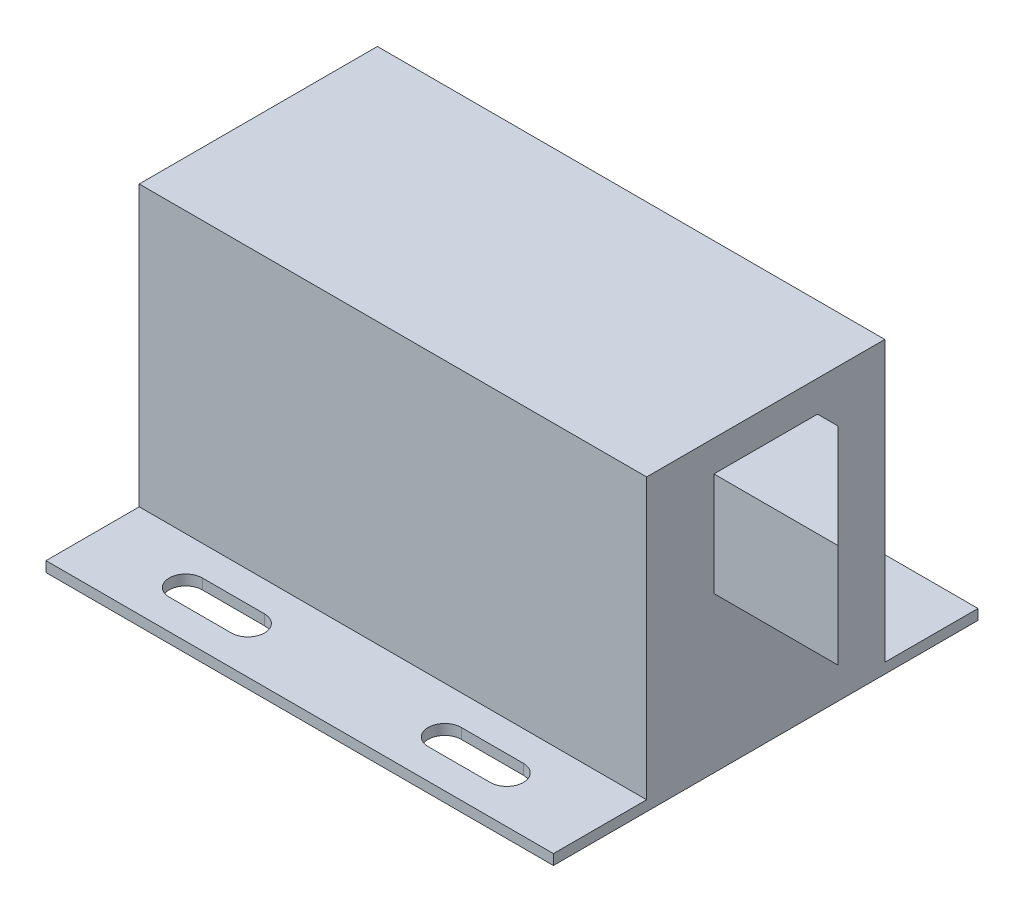
ISO-10303-21;
HEADER;
FILE_DESCRIPTION(('STEP AP214'),'2;1');
FILE_NAME('part.step','',(''),(''),'','','');
FILE_SCHEMA(('AUTOMOTIVE_DESIGN { 1 0 10303 214 1 1 1 1 }'));
ENDSEC;
DATA;
#1=APPLICATION_CONTEXT('core data for automotive mechanical design processes');
#2=APPLICATION_PROTOCOL_DEFINITION('international standard','automotive_design',2000,#1);
#3=PRODUCT_CONTEXT('',#1,'mechanical');
#4=PRODUCT('Part','Part','',(#3));
#5=PRODUCT_RELATED_PRODUCT_CATEGORY('part','',(#4));
#6=PRODUCT_DEFINITION_FORMATION('','',#4);
#7=PRODUCT_DEFINITION_CONTEXT('part definition',#1,'design');
#8=PRODUCT_DEFINITION('design','',#6,#7);
#9=PRODUCT_DEFINITION_SHAPE('','',#8);
#10=(LENGTH_UNIT() NAMED_UNIT(*) SI_UNIT(.MILLI.,.METRE.));
#11=(NAMED_UNIT(*) PLANE_ANGLE_UNIT() SI_UNIT($,.RADIAN.));
#12=(NAMED_UNIT(*) SI_UNIT($,.STERADIAN.) SOLID_ANGLE_UNIT());
#13=UNCERTAINTY_MEASURE_WITH_UNIT(LENGTH_MEASURE(1.E-05),#10,'distance_accuracy_value','');
#14=(GEOMETRIC_REPRESENTATION_CONTEXT(3) GLOBAL_UNCERTAINTY_ASSIGNED_CONTEXT((#13)) GLOBAL_UNIT_ASSIGNED_CONTEXT((#10,
#11,#12)) REPRESENTATION_CONTEXT('',''));
#15=CARTESIAN_POINT('',(0.,0.,0.));
#16=DIRECTION('',(0.,0.,1.));
#17=DIRECTION('',(1.,0.,0.));
#18=AXIS2_PLACEMENT_3D('',#15,#16,#17);
#19=CARTESIAN_POINT('',(49.,1.,0.));
#20=DIRECTION('',(-1.,0.,0.));
#21=DIRECTION('',(0.,0.,1.));
#22=AXIS2_PLACEMENT_3D('',#19,#20,#21);
#23=PLANE('',#22);
#24=DIRECTION('',(0.,0.,-1.));
#25=VECTOR('',#24,1.);
#26=CARTESIAN_POINT('',(49.,0.,0.));
#27=LINE('',#26,#25);
#28=CARTESIAN_POINT('',(49.,0.,0.));
#29=VERTEX_POINT('',#28);
#30=CARTESIAN_POINT('',(49.,0.,-41.));
#31=VERTEX_POINT('',#30);
#32=EDGE_CURVE('E336',#29,#31,#27,.T.);
#33=ORIENTED_EDGE('',*,*,#32,.T.);
#34=DIRECTION('',(0.,-1.,0.));
#35=VECTOR('',#34,1.);
#36=CARTESIAN_POINT('',(49.,1.,-41.));
#37=LINE('',#36,#35);
#38=CARTESIAN_POINT('',(49.,1.,-41.));
#39=VERTEX_POINT('',#38);
#40=EDGE_CURVE('E301',#39,#31,#37,.T.);
#41=ORIENTED_EDGE('',*,*,#40,.F.);
#42=DIRECTION('',(0.,0.,-1.));
#43=VECTOR('',#42,1.);
#44=CARTESIAN_POINT('',(49.,1.,0.));
#45=LINE('',#44,#43);
#46=CARTESIAN_POINT('',(49.,1.,-32.));
#47=VERTEX_POINT('',#46);
#48=EDGE_CURVE('E267',#47,#39,#45,.T.);
#49=ORIENTED_EDGE('',*,*,#48,.F.);
#50=DIRECTION('',(0.,-1.,0.));
#51=VECTOR('',#50,1.);
#52=CARTESIAN_POINT('',(49.,28.,-32.));
#53=LINE('',#52,#51);
#54=CARTESIAN_POINT('',(49.,28.,-32.));
#55=VERTEX_POINT('',#54);
#56=EDGE_CURVE('E274',#55,#47,#53,.T.);
#57=ORIENTED_EDGE('',*,*,#56,.F.);
#58=DIRECTION('',(0.,0.,-1.));
#59=VECTOR('',#58,1.);
#60=CARTESIAN_POINT('',(49.,28.,-32.));
#61=LINE('',#60,#59);
#62=CARTESIAN_POINT('',(49.,28.,-9.));
#63=VERTEX_POINT('',#62);
#64=EDGE_CURVE('E254',#63,#55,#61,.T.);
#65=ORIENTED_EDGE('',*,*,#64,.F.);
#66=DIRECTION('',(0.,-1.,0.));
#67=VECTOR('',#66,1.);
#68=CARTESIAN_POINT('',(49.,28.,-9.));
#69=LINE('',#68,#67);
#70=CARTESIAN_POINT('',(49.,1.,-9.));
#71=VERTEX_POINT('',#70);
#72=EDGE_CURVE('E270',#63,#71,#69,.T.);
#73=ORIENTED_EDGE('',*,*,#72,.T.);
#74=CARTESIAN_POINT('',(49.,1.,0.));
#75=VERTEX_POINT('',#74);
#76=EDGE_CURVE('E321',#75,#71,#45,.T.);
#77=ORIENTED_EDGE('',*,*,#76,.F.);
#78=DIRECTION('',(0.,-1.,0.));
#79=VECTOR('',#78,1.);
#80=CARTESIAN_POINT('',(49.,1.,0.));
#81=LINE('',#80,#79);
#82=EDGE_CURVE('E294',#75,#29,#81,.T.);
#83=ORIENTED_EDGE('',*,*,#82,.T.);
#84=EDGE_LOOP('',(#33,#41,#49,#57,#65,#73,#77,#83));
#85=FACE_BOUND('',#84,.T.);
#86=DIRECTION('',(0.,-1.,0.));
#87=VECTOR('',#86,1.);
#88=CARTESIAN_POINT('',(49.,15.,-15.5));
#89=LINE('',#88,#87);
#90=CARTESIAN_POINT('',(49.,25.,-15.5));
#91=VERTEX_POINT('',#90);
#92=CARTESIAN_POINT('',(49.,15.,-15.5));
#93=VERTEX_POINT('',#92);
#94=EDGE_CURVE('E229',#91,#93,#89,.T.);
#95=ORIENTED_EDGE('',*,*,#94,.F.);
#96=DIRECTION('',(0.,0.,1.));
#97=VECTOR('',#96,1.);
#98=CARTESIAN_POINT('',(49.,25.,-15.5));
#99=LINE('',#98,#97);
#100=CARTESIAN_POINT('',(49.,25.,-25.5));
#101=VERTEX_POINT('',#100);
#102=EDGE_CURVE('E233',#101,#91,#99,.T.);
#103=ORIENTED_EDGE('',*,*,#102,.F.);
#104=DIRECTION('',(0.,1.,0.));
#105=VECTOR('',#104,1.);
#106=CARTESIAN_POINT('',(49.,15.,-25.5));
#107=LINE('',#106,#105);
#108=CARTESIAN_POINT('',(49.,15.,-25.5));
#109=VERTEX_POINT('',#108);
#110=EDGE_CURVE('E238',#109,#101,#107,.T.);
#111=ORIENTED_EDGE('',*,*,#110,.F.);
#112=DIRECTION('',(0.,0.,-1.));
#113=VECTOR('',#112,1.);
#114=CARTESIAN_POINT('',(49.,15.,-15.5));
#115=LINE('',#114,#113);
#116=EDGE_CURVE('E242',#93,#109,#115,.T.);
#117=ORIENTED_EDGE('',*,*,#116,.F.);
#118=EDGE_LOOP('',(#95,#103,#111,#117));
#119=FACE_BOUND('',#118,.T.);
#120=ADVANCED_FACE('F33',(#85,#119),#23,.F.);
#121=CARTESIAN_POINT('',(0.,1.,0.));
#122=DIRECTION('',(0.,-1.,0.));
#123=DIRECTION('',(0.,0.,-1.));
#124=AXIS2_PLACEMENT_3D('',#121,#122,#123);
#125=PLANE('',#124);
#126=CARTESIAN_POINT('',(34.,1.,-36.5));
#127=DIRECTION('',(0.,1.,0.));
#128=DIRECTION('',(0.,0.,1.));
#129=AXIS2_PLACEMENT_3D('',#126,#127,#128);
#130=CIRCLE('',#129,1.59999999999999);
#131=CARTESIAN_POINT('',(34.,1.,-38.1));
#132=VERTEX_POINT('',#131);
#133=CARTESIAN_POINT('',(34.,1.,-34.9));
#134=VERTEX_POINT('',#133);
#135=EDGE_CURVE('E414',#132,#134,#130,.T.);
#136=ORIENTED_EDGE('',*,*,#135,.F.);
#137=DIRECTION('',(-1.,0.,0.));
#138=VECTOR('',#137,1.);
#139=CARTESIAN_POINT('',(34.,1.,-38.1));
#140=LINE('',#139,#138);
#141=CARTESIAN_POINT('',(40.,1.,-38.1));
#142=VERTEX_POINT('',#141);
#143=EDGE_CURVE('E410',#142,#132,#140,.T.);
#144=ORIENTED_EDGE('',*,*,#143,.F.);
#145=CARTESIAN_POINT('',(40.,1.,-36.5));
#146=DIRECTION('',(0.,1.,0.));
#147=DIRECTION('',(0.,0.,1.));
#148=AXIS2_PLACEMENT_3D('',#145,#146,#147);
#149=CIRCLE('',#148,1.59999999999999);
#150=CARTESIAN_POINT('',(40.,1.,-34.9));
#151=VERTEX_POINT('',#150);
#152=EDGE_CURVE('E426',#151,#142,#149,.T.);
#153=ORIENTED_EDGE('',*,*,#152,.F.);
#154=DIRECTION('',(1.,0.,0.));
#155=VECTOR('',#154,1.);
#156=CARTESIAN_POINT('',(34.,1.,-34.9));
#157=LINE('',#156,#155);
#158=EDGE_CURVE('E429',#134,#151,#157,.T.);
#159=ORIENTED_EDGE('',*,*,#158,.F.);
#160=EDGE_LOOP('',(#136,#144,#153,#159));
#161=FACE_BOUND('',#160,.T.);
#162=CARTESIAN_POINT('',(9.,1.,-36.5));
#163=DIRECTION('',(0.,1.,0.));
#164=DIRECTION('',(0.,0.,1.));
#165=AXIS2_PLACEMENT_3D('',#162,#163,#164);
#166=CIRCLE('',#165,1.59999999999999);
#167=CARTESIAN_POINT('',(9.,1.,-38.1));
#168=VERTEX_POINT('',#167);
#169=CARTESIAN_POINT('',(9.00000000000001,1.,-34.9));
#170=VERTEX_POINT('',#169);
#171=EDGE_CURVE('E384',#168,#170,#166,.T.);
#172=ORIENTED_EDGE('',*,*,#171,.F.);
#173=DIRECTION('',(-1.,0.,0.));
#174=VECTOR('',#173,1.);
#175=CARTESIAN_POINT('',(9.,1.,-38.1));
#176=LINE('',#175,#174);
#177=CARTESIAN_POINT('',(15.,1.,-38.1));
#178=VERTEX_POINT('',#177);
#179=EDGE_CURVE('E380',#178,#168,#176,.T.);
#180=ORIENTED_EDGE('',*,*,#179,.F.);
#181=CARTESIAN_POINT('',(15.,1.,-36.5));
#182=DIRECTION('',(0.,1.,0.));
#183=DIRECTION('',(0.,0.,1.));
#184=AXIS2_PLACEMENT_3D('',#181,#182,#183);
#185=CIRCLE('',#184,1.59999999999999);
#186=CARTESIAN_POINT('',(15.,1.,-34.9));
#187=VERTEX_POINT('',#186);
#188=EDGE_CURVE('E395',#187,#178,#185,.T.);
#189=ORIENTED_EDGE('',*,*,#188,.F.);
#190=DIRECTION('',(1.,0.,0.));
#191=VECTOR('',#190,1.);
#192=CARTESIAN_POINT('',(9.00000000000001,1.,-34.9));
#193=LINE('',#192,#191);
#194=EDGE_CURVE('E398',#170,#187,#193,.T.);
#195=ORIENTED_EDGE('',*,*,#194,.F.);
#196=EDGE_LOOP('',(#172,#180,#189,#195));
#197=FACE_BOUND('',#196,.T.);
#198=DIRECTION('',(-1.,0.,0.));
#199=VECTOR('',#198,1.);
#200=CARTESIAN_POINT('',(0.,1.,-32.));
#201=LINE('',#200,#199);
#202=CARTESIAN_POINT('',(0.,1.,-32.));
#203=VERTEX_POINT('',#202);
#204=EDGE_CURVE('E252',#47,#203,#201,.T.);
#205=ORIENTED_EDGE('',*,*,#204,.F.);
#206=ORIENTED_EDGE('',*,*,#48,.T.);
#207=DIRECTION('',(-1.,0.,0.));
#208=VECTOR('',#207,1.);
#209=CARTESIAN_POINT('',(0.,1.,-41.));
#210=LINE('',#209,#208);
#211=CARTESIAN_POINT('',(0.,1.,-41.));
#212=VERTEX_POINT('',#211);
#213=EDGE_CURVE('E318',#39,#212,#210,.T.);
#214=ORIENTED_EDGE('',*,*,#213,.T.);
#215=DIRECTION('',(0.,0.,1.));
#216=VECTOR('',#215,1.);
#217=CARTESIAN_POINT('',(0.,1.,0.));
#218=LINE('',#217,#216);
#219=EDGE_CURVE('E305',#212,#203,#218,.T.);
#220=ORIENTED_EDGE('',*,*,#219,.T.);
#221=EDGE_LOOP('',(#205,#206,#214,#220));
#222=FACE_BOUND('',#221,.T.);
#223=ADVANCED_FACE('F328',(#161,#197,#222),#125,.F.);
#224=CARTESIAN_POINT('',(15.,1.,-4.5));
#225=DIRECTION('',(0.,1.,0.));
#226=DIRECTION('',(0.,0.,1.));
#227=AXIS2_PLACEMENT_3D('',#224,#225,#226);
#228=CIRCLE('',#227,1.6);
#229=CARTESIAN_POINT('',(15.,1.,-2.9));
#230=VERTEX_POINT('',#229);
#231=CARTESIAN_POINT('',(15.,1.,-6.1));
#232=VERTEX_POINT('',#231);
#233=EDGE_CURVE('E476',#230,#232,#228,.T.);
#234=ORIENTED_EDGE('',*,*,#233,.F.);
#235=DIRECTION('',(1.,0.,0.));
#236=VECTOR('',#235,1.);
#237=CARTESIAN_POINT('',(15.,1.,-2.9));
#238=LINE('',#237,#236);
#239=CARTESIAN_POINT('',(9.,1.,-2.9));
#240=VERTEX_POINT('',#239);
#241=EDGE_CURVE('E472',#240,#230,#238,.T.);
#242=ORIENTED_EDGE('',*,*,#241,.F.);
#243=CARTESIAN_POINT('',(9.,1.,-4.5));
#244=DIRECTION('',(0.,1.,0.));
#245=DIRECTION('',(0.,0.,1.));
#246=AXIS2_PLACEMENT_3D('',#243,#244,#245);
#247=CIRCLE('',#246,1.6);
#248=CARTESIAN_POINT('',(9.,1.,-6.1));
#249=VERTEX_POINT('',#248);
#250=EDGE_CURVE('E486',#249,#240,#247,.T.);
#251=ORIENTED_EDGE('',*,*,#250,.F.);
#252=DIRECTION('',(-1.,0.,0.));
#253=VECTOR('',#252,1.);
#254=CARTESIAN_POINT('',(15.,1.,-6.1));
#255=LINE('',#254,#253);
#256=EDGE_CURVE('E489',#232,#249,#255,.T.);
#257=ORIENTED_EDGE('',*,*,#256,.F.);
#258=EDGE_LOOP('',(#234,#242,#251,#257));
#259=FACE_BOUND('',#258,.T.);
#260=CARTESIAN_POINT('',(34.,1.,-4.5));
#261=DIRECTION('',(0.,1.,0.));
#262=DIRECTION('',(0.,0.,1.));
#263=AXIS2_PLACEMENT_3D('',#260,#261,#262);
#264=CIRCLE('',#263,1.6);
#265=CARTESIAN_POINT('',(34.,1.,-6.1));
#266=VERTEX_POINT('',#265);
#267=CARTESIAN_POINT('',(34.,1.,-2.9));
#268=VERTEX_POINT('',#267);
#269=EDGE_CURVE('E445',#266,#268,#264,.T.);
#270=ORIENTED_EDGE('',*,*,#269,.F.);
#271=DIRECTION('',(-1.,0.,0.));
#272=VECTOR('',#271,1.);
#273=CARTESIAN_POINT('',(34.,1.,-6.1));
#274=LINE('',#273,#272);
#275=CARTESIAN_POINT('',(40.,1.,-6.1));
#276=VERTEX_POINT('',#275);
#277=EDGE_CURVE('E441',#276,#266,#274,.T.);
#278=ORIENTED_EDGE('',*,*,#277,.F.);
#279=CARTESIAN_POINT('',(40.,1.,-4.5));
#280=DIRECTION('',(0.,1.,0.));
#281=DIRECTION('',(0.,0.,1.));
#282=AXIS2_PLACEMENT_3D('',#279,#280,#281);
#283=CIRCLE('',#282,1.6);
#284=CARTESIAN_POINT('',(40.,1.,-2.9));
#285=VERTEX_POINT('',#284);
#286=EDGE_CURVE('E457',#285,#276,#283,.T.);
#287=ORIENTED_EDGE('',*,*,#286,.F.);
#288=DIRECTION('',(1.,0.,0.));
#289=VECTOR('',#288,1.);
#290=CARTESIAN_POINT('',(34.,1.,-2.9));
#291=LINE('',#290,#289);
#292=EDGE_CURVE('E460',#268,#285,#291,.T.);
#293=ORIENTED_EDGE('',*,*,#292,.F.);
#294=EDGE_LOOP('',(#270,#278,#287,#293));
#295=FACE_BOUND('',#294,.T.);
#296=DIRECTION('',(1.,0.,0.));
#297=VECTOR('',#296,1.);
#298=CARTESIAN_POINT('',(0.,1.,-9.));
#299=LINE('',#298,#297);
#300=CARTESIAN_POINT('',(0.,1.,-9.));
#301=VERTEX_POINT('',#300);
#302=EDGE_CURVE('E230',#301,#71,#299,.T.);
#303=ORIENTED_EDGE('',*,*,#302,.F.);
#304=CARTESIAN_POINT('',(0.,1.,0.));
#305=VERTEX_POINT('',#304);
#306=EDGE_CURVE('E309',#301,#305,#218,.T.);
#307=ORIENTED_EDGE('',*,*,#306,.T.);
#308=DIRECTION('',(1.,0.,0.));
#309=VECTOR('',#308,1.);
#310=CARTESIAN_POINT('',(0.,1.,0.));
#311=LINE('',#310,#309);
#312=EDGE_CURVE('E308',#305,#75,#311,.T.);
#313=ORIENTED_EDGE('',*,*,#312,.T.);
#314=ORIENTED_EDGE('',*,*,#76,.T.);
#315=EDGE_LOOP('',(#303,#307,#313,#314));
#316=FACE_BOUND('',#315,.T.);
#317=ADVANCED_FACE('F360',(#259,#295,#316),#125,.F.);
#318=CARTESIAN_POINT('',(0.,0.,0.));
#319=DIRECTION('',(0.,-1.,0.));
#320=DIRECTION('',(0.,0.,-1.));
#321=AXIS2_PLACEMENT_3D('',#318,#319,#320);
#322=PLANE('',#321);
#323=DIRECTION('',(-1.,0.,0.));
#324=VECTOR('',#323,1.);
#325=CARTESIAN_POINT('',(34.,0.,-6.1));
#326=LINE('',#325,#324);
#327=CARTESIAN_POINT('',(40.,0.,-6.1));
#328=VERTEX_POINT('',#327);
#329=CARTESIAN_POINT('',(34.,0.,-6.1));
#330=VERTEX_POINT('',#329);
#331=EDGE_CURVE('E442',#328,#330,#326,.T.);
#332=ORIENTED_EDGE('',*,*,#331,.T.);
#333=CARTESIAN_POINT('',(34.,0.,-4.5));
#334=DIRECTION('',(0.,1.,0.));
#335=DIRECTION('',(0.,0.,1.));
#336=AXIS2_PLACEMENT_3D('',#333,#334,#335);
#337=CIRCLE('',#336,1.6);
#338=CARTESIAN_POINT('',(34.,0.,-2.9));
#339=VERTEX_POINT('',#338);
#340=EDGE_CURVE('E452',#330,#339,#337,.T.);
#341=ORIENTED_EDGE('',*,*,#340,.T.);
#342=DIRECTION('',(1.,0.,0.));
#343=VECTOR('',#342,1.);
#344=CARTESIAN_POINT('',(34.,0.,-2.9));
#345=LINE('',#344,#343);
#346=CARTESIAN_POINT('',(40.,0.,-2.9));
#347=VERTEX_POINT('',#346);
#348=EDGE_CURVE('E449',#339,#347,#345,.T.);
#349=ORIENTED_EDGE('',*,*,#348,.T.);
#350=CARTESIAN_POINT('',(40.,0.,-4.5));
#351=DIRECTION('',(0.,1.,0.));
#352=DIRECTION('',(0.,0.,1.));
#353=AXIS2_PLACEMENT_3D('',#350,#351,#352);
#354=CIRCLE('',#353,1.6);
#355=EDGE_CURVE('E446',#347,#328,#354,.T.);
#356=ORIENTED_EDGE('',*,*,#355,.T.);
#357=EDGE_LOOP('',(#332,#341,#349,#356));
#358=FACE_BOUND('',#357,.T.);
#359=DIRECTION('',(-1.,0.,0.));
#360=VECTOR('',#359,1.);
#361=CARTESIAN_POINT('',(9.,0.,-38.1));
#362=LINE('',#361,#360);
#363=CARTESIAN_POINT('',(15.,0.,-38.1));
#364=VERTEX_POINT('',#363);
#365=CARTESIAN_POINT('',(9.,0.,-38.1));
#366=VERTEX_POINT('',#365);
#367=EDGE_CURVE('E381',#364,#366,#362,.T.);
#368=ORIENTED_EDGE('',*,*,#367,.T.);
#369=CARTESIAN_POINT('',(9.,0.,-36.5));
#370=DIRECTION('',(0.,1.,0.));
#371=DIRECTION('',(0.,0.,1.));
#372=AXIS2_PLACEMENT_3D('',#369,#370,#371);
#373=CIRCLE('',#372,1.59999999999999);
#374=CARTESIAN_POINT('',(9.00000000000001,0.,-34.9));
#375=VERTEX_POINT('',#374);
#376=EDGE_CURVE('E391',#366,#375,#373,.T.);
#377=ORIENTED_EDGE('',*,*,#376,.T.);
#378=DIRECTION('',(1.,0.,0.));
#379=VECTOR('',#378,1.);
#380=CARTESIAN_POINT('',(9.00000000000001,0.,-34.9));
#381=LINE('',#380,#379);
#382=CARTESIAN_POINT('',(15.,0.,-34.9));
#383=VERTEX_POINT('',#382);
#384=EDGE_CURVE('E388',#375,#383,#381,.T.);
#385=ORIENTED_EDGE('',*,*,#384,.T.);
#386=CARTESIAN_POINT('',(15.,0.,-36.5));
#387=DIRECTION('',(0.,1.,0.));
#388=DIRECTION('',(0.,0.,1.));
#389=AXIS2_PLACEMENT_3D('',#386,#387,#388);
#390=CIRCLE('',#389,1.59999999999999);
#391=EDGE_CURVE('E385',#383,#364,#390,.T.);
#392=ORIENTED_EDGE('',*,*,#391,.T.);
#393=EDGE_LOOP('',(#368,#377,#385,#392));
#394=FACE_BOUND('',#393,.T.);
#395=DIRECTION('',(0.,0.,1.));
#396=VECTOR('',#395,1.);
#397=CARTESIAN_POINT('',(0.,0.,0.));
#398=LINE('',#397,#396);
#399=CARTESIAN_POINT('',(0.,0.,-41.));
#400=VERTEX_POINT('',#399);
#401=CARTESIAN_POINT('',(0.,0.,0.));
#402=VERTEX_POINT('',#401);
#403=EDGE_CURVE('E365',#400,#402,#398,.T.);
#404=ORIENTED_EDGE('',*,*,#403,.F.);
#405=DIRECTION('',(-1.,0.,0.));
#406=VECTOR('',#405,1.);
#407=CARTESIAN_POINT('',(0.,0.,-41.));
#408=LINE('',#407,#406);
#409=EDGE_CURVE('E342',#31,#400,#408,.T.);
#410=ORIENTED_EDGE('',*,*,#409,.F.);
#411=ORIENTED_EDGE('',*,*,#32,.F.);
#412=DIRECTION('',(1.,0.,0.));
#413=VECTOR('',#412,1.);
#414=CARTESIAN_POINT('',(0.,0.,0.));
#415=LINE('',#414,#413);
#416=EDGE_CURVE('E362',#402,#29,#415,.T.);
#417=ORIENTED_EDGE('',*,*,#416,.F.);
#418=EDGE_LOOP('',(#404,#410,#411,#417));
#419=FACE_BOUND('',#418,.T.);
#420=DIRECTION('',(-1.,0.,0.));
#421=VECTOR('',#420,1.);
#422=CARTESIAN_POINT('',(34.,0.,-38.1));
#423=LINE('',#422,#421);
#424=CARTESIAN_POINT('',(40.,0.,-38.1));
#425=VERTEX_POINT('',#424);
#426=CARTESIAN_POINT('',(34.,0.,-38.1));
#427=VERTEX_POINT('',#426);
#428=EDGE_CURVE('E411',#425,#427,#423,.T.);
#429=ORIENTED_EDGE('',*,*,#428,.T.);
#430=CARTESIAN_POINT('',(34.,0.,-36.5));
#431=DIRECTION('',(0.,1.,0.));
#432=DIRECTION('',(0.,0.,1.));
#433=AXIS2_PLACEMENT_3D('',#430,#431,#432);
#434=CIRCLE('',#433,1.59999999999999);
#435=CARTESIAN_POINT('',(34.,0.,-34.9));
#436=VERTEX_POINT('',#435);
#437=EDGE_CURVE('E421',#427,#436,#434,.T.);
#438=ORIENTED_EDGE('',*,*,#437,.T.);
#439=DIRECTION('',(1.,0.,0.));
#440=VECTOR('',#439,1.);
#441=CARTESIAN_POINT('',(34.,0.,-34.9));
#442=LINE('',#441,#440);
#443=CARTESIAN_POINT('',(40.,0.,-34.9));
#444=VERTEX_POINT('',#443);
#445=EDGE_CURVE('E418',#436,#444,#442,.T.);
#446=ORIENTED_EDGE('',*,*,#445,.T.);
#447=CARTESIAN_POINT('',(40.,0.,-36.5));
#448=DIRECTION('',(0.,1.,0.));
#449=DIRECTION('',(0.,0.,1.));
#450=AXIS2_PLACEMENT_3D('',#447,#448,#449);
#451=CIRCLE('',#450,1.59999999999999);
#452=EDGE_CURVE('E415',#444,#425,#451,.T.);
#453=ORIENTED_EDGE('',*,*,#452,.T.);
#454=EDGE_LOOP('',(#429,#438,#446,#453));
#455=FACE_BOUND('',#454,.T.);
#456=DIRECTION('',(1.,0.,0.));
#457=VECTOR('',#456,1.);
#458=CARTESIAN_POINT('',(15.,0.,-2.9));
#459=LINE('',#458,#457);
#460=CARTESIAN_POINT('',(9.,0.,-2.9));
#461=VERTEX_POINT('',#460);
#462=CARTESIAN_POINT('',(15.,0.,-2.9));
#463=VERTEX_POINT('',#462);
#464=EDGE_CURVE('E473',#461,#463,#459,.T.);
#465=ORIENTED_EDGE('',*,*,#464,.T.);
#466=CARTESIAN_POINT('',(15.,0.,-4.5));
#467=DIRECTION('',(0.,1.,0.));
#468=DIRECTION('',(0.,0.,1.));
#469=AXIS2_PLACEMENT_3D('',#466,#467,#468);
#470=CIRCLE('',#469,1.6);
#471=CARTESIAN_POINT('',(15.,0.,-6.1));
#472=VERTEX_POINT('',#471);
#473=EDGE_CURVE('E279',#463,#472,#470,.T.);
#474=ORIENTED_EDGE('',*,*,#473,.T.);
#475=DIRECTION('',(-1.,0.,0.));
#476=VECTOR('',#475,1.);
#477=CARTESIAN_POINT('',(15.,0.,-6.1));
#478=LINE('',#477,#476);
#479=CARTESIAN_POINT('',(9.,0.,-6.1));
#480=VERTEX_POINT('',#479);
#481=EDGE_CURVE('E480',#472,#480,#478,.T.);
#482=ORIENTED_EDGE('',*,*,#481,.T.);
#483=CARTESIAN_POINT('',(9.,0.,-4.5));
#484=DIRECTION('',(0.,1.,0.));
#485=DIRECTION('',(0.,0.,1.));
#486=AXIS2_PLACEMENT_3D('',#483,#484,#485);
#487=CIRCLE('',#486,1.6);
#488=EDGE_CURVE('E477',#480,#461,#487,.T.);
#489=ORIENTED_EDGE('',*,*,#488,.T.);
#490=EDGE_LOOP('',(#465,#474,#482,#489));
#491=FACE_BOUND('',#490,.T.);
#492=ADVANCED_FACE('F508',(#358,#394,#419,#455,#491),#322,.T.);
#493=CARTESIAN_POINT('',(0.,1.,0.));
#494=DIRECTION('',(1.,0.,0.));
#495=DIRECTION('',(0.,0.,-1.));
#496=AXIS2_PLACEMENT_3D('',#493,#494,#495);
#497=PLANE('',#496);
#498=ORIENTED_EDGE('',*,*,#403,.T.);
#499=DIRECTION('',(0.,-1.,0.));
#500=VECTOR('',#499,1.);
#501=CARTESIAN_POINT('',(0.,1.,0.));
#502=LINE('',#501,#500);
#503=EDGE_CURVE('E292',#305,#402,#502,.T.);
#504=ORIENTED_EDGE('',*,*,#503,.F.);
#505=ORIENTED_EDGE('',*,*,#306,.F.);
#506=DIRECTION('',(0.,-1.,0.));
#507=VECTOR('',#506,1.);
#508=CARTESIAN_POINT('',(0.,28.,-9.));
#509=LINE('',#508,#507);
#510=CARTESIAN_POINT('',(0.,28.,-9.));
#511=VERTEX_POINT('',#510);
#512=EDGE_CURVE('E273',#511,#301,#509,.T.);
#513=ORIENTED_EDGE('',*,*,#512,.F.);
#514=DIRECTION('',(0.,0.,1.));
#515=VECTOR('',#514,1.);
#516=CARTESIAN_POINT('',(0.,28.,-32.));
#517=LINE('',#516,#515);
#518=CARTESIAN_POINT('',(0.,28.,-32.));
#519=VERTEX_POINT('',#518);
#520=EDGE_CURVE('E248',#519,#511,#517,.T.);
#521=ORIENTED_EDGE('',*,*,#520,.F.);
#522=DIRECTION('',(0.,-1.,0.));
#523=VECTOR('',#522,1.);
#524=CARTESIAN_POINT('',(0.,28.,-32.));
#525=LINE('',#524,#523);
#526=EDGE_CURVE('E258',#519,#203,#525,.T.);
#527=ORIENTED_EDGE('',*,*,#526,.T.);
#528=ORIENTED_EDGE('',*,*,#219,.F.);
#529=DIRECTION('',(0.,-1.,0.));
#530=VECTOR('',#529,1.);
#531=CARTESIAN_POINT('',(0.,1.,-41.));
#532=LINE('',#531,#530);
#533=EDGE_CURVE('E324',#212,#400,#532,.T.);
#534=ORIENTED_EDGE('',*,*,#533,.T.);
#535=EDGE_LOOP('',(#498,#504,#505,#513,#521,#527,#528,#534));
#536=FACE_BOUND('',#535,.T.);
#537=ADVANCED_FACE('F346',(#536),#497,.F.);
#538=CARTESIAN_POINT('',(0.,1.,0.));
#539=DIRECTION('',(0.,0.,-1.));
#540=DIRECTION('',(-1.,0.,0.));
#541=AXIS2_PLACEMENT_3D('',#538,#539,#540);
#542=PLANE('',#541);
#543=ORIENTED_EDGE('',*,*,#416,.T.);
#544=ORIENTED_EDGE('',*,*,#82,.F.);
#545=ORIENTED_EDGE('',*,*,#312,.F.);
#546=ORIENTED_EDGE('',*,*,#503,.T.);
#547=EDGE_LOOP('',(#543,#544,#545,#546));
#548=FACE_BOUND('',#547,.T.);
#549=ADVANCED_FACE('F531',(#548),#542,.F.);
#550=CARTESIAN_POINT('',(0.,1.,-41.));
#551=DIRECTION('',(0.,0.,1.));
#552=DIRECTION('',(1.,0.,0.));
#553=AXIS2_PLACEMENT_3D('',#550,#551,#552);
#554=PLANE('',#553);
#555=ORIENTED_EDGE('',*,*,#409,.T.);
#556=ORIENTED_EDGE('',*,*,#533,.F.);
#557=ORIENTED_EDGE('',*,*,#213,.F.);
#558=ORIENTED_EDGE('',*,*,#40,.T.);
#559=EDGE_LOOP('',(#555,#556,#557,#558));
#560=FACE_BOUND('',#559,.T.);
#561=ADVANCED_FACE('F339',(#560),#554,.F.);
#562=CARTESIAN_POINT('',(9.,1.,-36.5));
#563=DIRECTION('',(0.,-1.,0.));
#564=DIRECTION('',(0.,0.,-1.));
#565=AXIS2_PLACEMENT_3D('',#562,#563,#564);
#566=CYLINDRICAL_SURFACE('',#565,1.59999999999999);
#567=ORIENTED_EDGE('',*,*,#376,.F.);
#568=DIRECTION('',(0.,-1.,0.));
#569=VECTOR('',#568,1.);
#570=CARTESIAN_POINT('',(9.,1.,-38.1));
#571=LINE('',#570,#569);
#572=EDGE_CURVE('E375',#168,#366,#571,.T.);
#573=ORIENTED_EDGE('',*,*,#572,.F.);
#574=ORIENTED_EDGE('',*,*,#171,.T.);
#575=DIRECTION('',(0.,-1.,0.));
#576=VECTOR('',#575,1.);
#577=CARTESIAN_POINT('',(9.00000000000001,1.,-34.9));
#578=LINE('',#577,#576);
#579=EDGE_CURVE('E313',#170,#375,#578,.T.);
#580=ORIENTED_EDGE('',*,*,#579,.T.);
#581=EDGE_LOOP('',(#567,#573,#574,#580));
#582=FACE_BOUND('',#581,.T.);
#583=ADVANCED_FACE('F543',(#582),#566,.F.);
#584=CARTESIAN_POINT('',(9.00000000000001,1.,-34.9));
#585=DIRECTION('',(0.,0.,-1.));
#586=DIRECTION('',(-1.,0.,0.));
#587=AXIS2_PLACEMENT_3D('',#584,#585,#586);
#588=PLANE('',#587);
#589=ORIENTED_EDGE('',*,*,#384,.F.);
#590=ORIENTED_EDGE('',*,*,#579,.F.);
#591=ORIENTED_EDGE('',*,*,#194,.T.);
#592=DIRECTION('',(0.,-1.,0.));
#593=VECTOR('',#592,1.);
#594=CARTESIAN_POINT('',(15.,1.,-34.9));
#595=LINE('',#594,#593);
#596=EDGE_CURVE('E367',#187,#383,#595,.T.);
#597=ORIENTED_EDGE('',*,*,#596,.T.);
#598=EDGE_LOOP('',(#589,#590,#591,#597));
#599=FACE_BOUND('',#598,.T.);
#600=ADVANCED_FACE('F546',(#599),#588,.T.);
#601=CARTESIAN_POINT('',(15.,1.,-36.5));
#602=DIRECTION('',(0.,-1.,0.));
#603=DIRECTION('',(0.,0.,-1.));
#604=AXIS2_PLACEMENT_3D('',#601,#602,#603);
#605=CYLINDRICAL_SURFACE('',#604,1.59999999999999);
#606=ORIENTED_EDGE('',*,*,#391,.F.);
#607=ORIENTED_EDGE('',*,*,#596,.F.);
#608=ORIENTED_EDGE('',*,*,#188,.T.);
#609=DIRECTION('',(0.,-1.,0.));
#610=VECTOR('',#609,1.);
#611=CARTESIAN_POINT('',(15.,1.,-38.1));
#612=LINE('',#611,#610);
#613=EDGE_CURVE('E371',#178,#364,#612,.T.);
#614=ORIENTED_EDGE('',*,*,#613,.T.);
#615=EDGE_LOOP('',(#606,#607,#608,#614));
#616=FACE_BOUND('',#615,.T.);
#617=ADVANCED_FACE('F549',(#616),#605,.F.);
#618=CARTESIAN_POINT('',(9.,1.,-38.1));
#619=DIRECTION('',(0.,0.,1.));
#620=DIRECTION('',(1.,0.,0.));
#621=AXIS2_PLACEMENT_3D('',#618,#619,#620);
#622=PLANE('',#621);
#623=ORIENTED_EDGE('',*,*,#367,.F.);
#624=ORIENTED_EDGE('',*,*,#613,.F.);
#625=ORIENTED_EDGE('',*,*,#179,.T.);
#626=ORIENTED_EDGE('',*,*,#572,.T.);
#627=EDGE_LOOP('',(#623,#624,#625,#626));
#628=FACE_BOUND('',#627,.T.);
#629=ADVANCED_FACE('F552',(#628),#622,.T.);
#630=CARTESIAN_POINT('',(34.,1.,-36.5));
#631=DIRECTION('',(0.,-1.,0.));
#632=DIRECTION('',(0.,0.,-1.));
#633=AXIS2_PLACEMENT_3D('',#630,#631,#632);
#634=CYLINDRICAL_SURFACE('',#633,1.59999999999999);
#635=ORIENTED_EDGE('',*,*,#437,.F.);
#636=DIRECTION('',(0.,-1.,0.));
#637=VECTOR('',#636,1.);
#638=CARTESIAN_POINT('',(34.,1.,-38.1));
#639=LINE('',#638,#637);
#640=EDGE_CURVE('E407',#132,#427,#639,.T.);
#641=ORIENTED_EDGE('',*,*,#640,.F.);
#642=ORIENTED_EDGE('',*,*,#135,.T.);
#643=DIRECTION('',(0.,-1.,0.));
#644=VECTOR('',#643,1.);
#645=CARTESIAN_POINT('',(34.,1.,-34.9));
#646=LINE('',#645,#644);
#647=EDGE_CURVE('E393',#134,#436,#646,.T.);
#648=ORIENTED_EDGE('',*,*,#647,.T.);
#649=EDGE_LOOP('',(#635,#641,#642,#648));
#650=FACE_BOUND('',#649,.T.);
#651=ADVANCED_FACE('F556',(#650),#634,.F.);
#652=CARTESIAN_POINT('',(34.,1.,-34.9));
#653=DIRECTION('',(0.,0.,-1.));
#654=DIRECTION('',(-1.,0.,0.));
#655=AXIS2_PLACEMENT_3D('',#652,#653,#654);
#656=PLANE('',#655);
#657=ORIENTED_EDGE('',*,*,#445,.F.);
#658=ORIENTED_EDGE('',*,*,#647,.F.);
#659=ORIENTED_EDGE('',*,*,#158,.T.);
#660=DIRECTION('',(0.,-1.,0.));
#661=VECTOR('',#660,1.);
#662=CARTESIAN_POINT('',(40.,1.,-34.9));
#663=LINE('',#662,#661);
#664=EDGE_CURVE('E403',#151,#444,#663,.T.);
#665=ORIENTED_EDGE('',*,*,#664,.T.);
#666=EDGE_LOOP('',(#657,#658,#659,#665));
#667=FACE_BOUND('',#666,.T.);
#668=ADVANCED_FACE('F560',(#667),#656,.T.);
#669=CARTESIAN_POINT('',(40.,1.,-36.5));
#670=DIRECTION('',(0.,-1.,0.));
#671=DIRECTION('',(0.,0.,-1.));
#672=AXIS2_PLACEMENT_3D('',#669,#670,#671);
#673=CYLINDRICAL_SURFACE('',#672,1.59999999999999);
#674=ORIENTED_EDGE('',*,*,#452,.F.);
#675=ORIENTED_EDGE('',*,*,#664,.F.);
#676=ORIENTED_EDGE('',*,*,#152,.T.);
#677=DIRECTION('',(0.,-1.,0.));
#678=VECTOR('',#677,1.);
#679=CARTESIAN_POINT('',(40.,1.,-38.1));
#680=LINE('',#679,#678);
#681=EDGE_CURVE('E405',#142,#425,#680,.T.);
#682=ORIENTED_EDGE('',*,*,#681,.T.);
#683=EDGE_LOOP('',(#674,#675,#676,#682));
#684=FACE_BOUND('',#683,.T.);
#685=ADVANCED_FACE('F564',(#684),#673,.F.);
#686=CARTESIAN_POINT('',(34.,1.,-38.1));
#687=DIRECTION('',(0.,0.,1.));
#688=DIRECTION('',(1.,0.,0.));
#689=AXIS2_PLACEMENT_3D('',#686,#687,#688);
#690=PLANE('',#689);
#691=ORIENTED_EDGE('',*,*,#428,.F.);
#692=ORIENTED_EDGE('',*,*,#681,.F.);
#693=ORIENTED_EDGE('',*,*,#143,.T.);
#694=ORIENTED_EDGE('',*,*,#640,.T.);
#695=EDGE_LOOP('',(#691,#692,#693,#694));
#696=FACE_BOUND('',#695,.T.);
#697=ADVANCED_FACE('F568',(#696),#690,.T.);
#698=CARTESIAN_POINT('',(34.,1.,-4.5));
#699=DIRECTION('',(0.,-1.,0.));
#700=DIRECTION('',(0.,0.,-1.));
#701=AXIS2_PLACEMENT_3D('',#698,#699,#700);
#702=CYLINDRICAL_SURFACE('',#701,1.6);
#703=ORIENTED_EDGE('',*,*,#340,.F.);
#704=DIRECTION('',(0.,-1.,0.));
#705=VECTOR('',#704,1.);
#706=CARTESIAN_POINT('',(34.,1.,-6.1));
#707=LINE('',#706,#705);
#708=EDGE_CURVE('E438',#266,#330,#707,.T.);
#709=ORIENTED_EDGE('',*,*,#708,.F.);
#710=ORIENTED_EDGE('',*,*,#269,.T.);
#711=DIRECTION('',(0.,-1.,0.));
#712=VECTOR('',#711,1.);
#713=CARTESIAN_POINT('',(34.,1.,-2.9));
#714=LINE('',#713,#712);
#715=EDGE_CURVE('E424',#268,#339,#714,.T.);
#716=ORIENTED_EDGE('',*,*,#715,.T.);
#717=EDGE_LOOP('',(#703,#709,#710,#716));
#718=FACE_BOUND('',#717,.T.);
#719=ADVANCED_FACE('F572',(#718),#702,.F.);
#720=CARTESIAN_POINT('',(34.,1.,-2.9));
#721=DIRECTION('',(0.,0.,-1.));
#722=DIRECTION('',(-1.,0.,0.));
#723=AXIS2_PLACEMENT_3D('',#720,#721,#722);
#724=PLANE('',#723);
#725=ORIENTED_EDGE('',*,*,#348,.F.);
#726=ORIENTED_EDGE('',*,*,#715,.F.);
#727=ORIENTED_EDGE('',*,*,#292,.T.);
#728=DIRECTION('',(0.,-1.,0.));
#729=VECTOR('',#728,1.);
#730=CARTESIAN_POINT('',(40.,1.,-2.9));
#731=LINE('',#730,#729);
#732=EDGE_CURVE('E434',#285,#347,#731,.T.);
#733=ORIENTED_EDGE('',*,*,#732,.T.);
#734=EDGE_LOOP('',(#725,#726,#727,#733));
#735=FACE_BOUND('',#734,.T.);
#736=ADVANCED_FACE('F576',(#735),#724,.T.);
#737=CARTESIAN_POINT('',(40.,1.,-4.5));
#738=DIRECTION('',(0.,-1.,0.));
#739=DIRECTION('',(0.,0.,-1.));
#740=AXIS2_PLACEMENT_3D('',#737,#738,#739);
#741=CYLINDRICAL_SURFACE('',#740,1.6);
#742=ORIENTED_EDGE('',*,*,#355,.F.);
#743=ORIENTED_EDGE('',*,*,#732,.F.);
#744=ORIENTED_EDGE('',*,*,#286,.T.);
#745=DIRECTION('',(0.,-1.,0.));
#746=VECTOR('',#745,1.);
#747=CARTESIAN_POINT('',(40.,1.,-6.1));
#748=LINE('',#747,#746);
#749=EDGE_CURVE('E436',#276,#328,#748,.T.);
#750=ORIENTED_EDGE('',*,*,#749,.T.);
#751=EDGE_LOOP('',(#742,#743,#744,#750));
#752=FACE_BOUND('',#751,.T.);
#753=ADVANCED_FACE('F580',(#752),#741,.F.);
#754=CARTESIAN_POINT('',(34.,1.,-6.1));
#755=DIRECTION('',(0.,0.,1.));
#756=DIRECTION('',(1.,0.,0.));
#757=AXIS2_PLACEMENT_3D('',#754,#755,#756);
#758=PLANE('',#757);
#759=ORIENTED_EDGE('',*,*,#331,.F.);
#760=ORIENTED_EDGE('',*,*,#749,.F.);
#761=ORIENTED_EDGE('',*,*,#277,.T.);
#762=ORIENTED_EDGE('',*,*,#708,.T.);
#763=EDGE_LOOP('',(#759,#760,#761,#762));
#764=FACE_BOUND('',#763,.T.);
#765=ADVANCED_FACE('F584',(#764),#758,.T.);
#766=CARTESIAN_POINT('',(15.,1.,-4.5));
#767=DIRECTION('',(0.,-1.,0.));
#768=DIRECTION('',(0.,0.,-1.));
#769=AXIS2_PLACEMENT_3D('',#766,#767,#768);
#770=CYLINDRICAL_SURFACE('',#769,1.6);
#771=ORIENTED_EDGE('',*,*,#473,.F.);
#772=DIRECTION('',(0.,-1.,0.));
#773=VECTOR('',#772,1.);
#774=CARTESIAN_POINT('',(15.,1.,-2.9));
#775=LINE('',#774,#773);
#776=EDGE_CURVE('E469',#230,#463,#775,.T.);
#777=ORIENTED_EDGE('',*,*,#776,.F.);
#778=ORIENTED_EDGE('',*,*,#233,.T.);
#779=DIRECTION('',(0.,-1.,0.));
#780=VECTOR('',#779,1.);
#781=CARTESIAN_POINT('',(15.,1.,-6.1));
#782=LINE('',#781,#780);
#783=EDGE_CURVE('E455',#232,#472,#782,.T.);
#784=ORIENTED_EDGE('',*,*,#783,.T.);
#785=EDGE_LOOP('',(#771,#777,#778,#784));
#786=FACE_BOUND('',#785,.T.);
#787=ADVANCED_FACE('F494',(#786),#770,.F.);
#788=CARTESIAN_POINT('',(15.,1.,-6.1));
#789=DIRECTION('',(0.,0.,1.));
#790=DIRECTION('',(1.,0.,0.));
#791=AXIS2_PLACEMENT_3D('',#788,#789,#790);
#792=PLANE('',#791);
#793=ORIENTED_EDGE('',*,*,#481,.F.);
#794=ORIENTED_EDGE('',*,*,#783,.F.);
#795=ORIENTED_EDGE('',*,*,#256,.T.);
#796=DIRECTION('',(0.,-1.,0.));
#797=VECTOR('',#796,1.);
#798=CARTESIAN_POINT('',(9.,1.,-6.1));
#799=LINE('',#798,#797);
#800=EDGE_CURVE('E465',#249,#480,#799,.T.);
#801=ORIENTED_EDGE('',*,*,#800,.T.);
#802=EDGE_LOOP('',(#793,#794,#795,#801));
#803=FACE_BOUND('',#802,.T.);
#804=ADVANCED_FACE('F499',(#803),#792,.T.);
#805=CARTESIAN_POINT('',(9.,1.,-4.5));
#806=DIRECTION('',(0.,-1.,0.));
#807=DIRECTION('',(0.,0.,-1.));
#808=AXIS2_PLACEMENT_3D('',#805,#806,#807);
#809=CYLINDRICAL_SURFACE('',#808,1.6);
#810=ORIENTED_EDGE('',*,*,#488,.F.);
#811=ORIENTED_EDGE('',*,*,#800,.F.);
#812=ORIENTED_EDGE('',*,*,#250,.T.);
#813=DIRECTION('',(0.,-1.,0.));
#814=VECTOR('',#813,1.);
#815=CARTESIAN_POINT('',(9.,1.,-2.9));
#816=LINE('',#815,#814);
#817=EDGE_CURVE('E467',#240,#461,#816,.T.);
#818=ORIENTED_EDGE('',*,*,#817,.T.);
#819=EDGE_LOOP('',(#810,#811,#812,#818));
#820=FACE_BOUND('',#819,.T.);
#821=ADVANCED_FACE('F505',(#820),#809,.F.);
#822=CARTESIAN_POINT('',(15.,1.,-2.9));
#823=DIRECTION('',(0.,0.,-1.));
#824=DIRECTION('',(-1.,0.,0.));
#825=AXIS2_PLACEMENT_3D('',#822,#823,#824);
#826=PLANE('',#825);
#827=ORIENTED_EDGE('',*,*,#464,.F.);
#828=ORIENTED_EDGE('',*,*,#817,.F.);
#829=ORIENTED_EDGE('',*,*,#241,.T.);
#830=ORIENTED_EDGE('',*,*,#776,.T.);
#831=EDGE_LOOP('',(#827,#828,#829,#830));
#832=FACE_BOUND('',#831,.T.);
#833=ADVANCED_FACE('F510',(#832),#826,.T.);
#834=CARTESIAN_POINT('',(0.,28.,-9.));
#835=DIRECTION('',(0.,0.,-1.));
#836=DIRECTION('',(-1.,0.,0.));
#837=AXIS2_PLACEMENT_3D('',#834,#835,#836);
#838=PLANE('',#837);
#839=ORIENTED_EDGE('',*,*,#302,.T.);
#840=ORIENTED_EDGE('',*,*,#72,.F.);
#841=DIRECTION('',(1.,0.,0.));
#842=VECTOR('',#841,1.);
#843=CARTESIAN_POINT('',(0.,28.,-9.));
#844=LINE('',#843,#842);
#845=EDGE_CURVE('E251',#511,#63,#844,.T.);
#846=ORIENTED_EDGE('',*,*,#845,.F.);
#847=ORIENTED_EDGE('',*,*,#512,.T.);
#848=EDGE_LOOP('',(#839,#840,#846,#847));
#849=FACE_BOUND('',#848,.T.);
#850=ADVANCED_FACE('F358',(#849),#838,.F.);
#851=CARTESIAN_POINT('',(0.,28.,-32.));
#852=DIRECTION('',(0.,0.,1.));
#853=DIRECTION('',(1.,0.,0.));
#854=AXIS2_PLACEMENT_3D('',#851,#852,#853);
#855=PLANE('',#854);
#856=ORIENTED_EDGE('',*,*,#204,.T.);
#857=ORIENTED_EDGE('',*,*,#526,.F.);
#858=DIRECTION('',(-1.,0.,0.));
#859=VECTOR('',#858,1.);
#860=CARTESIAN_POINT('',(0.,28.,-32.));
#861=LINE('',#860,#859);
#862=EDGE_CURVE('E256',#55,#519,#861,.T.);
#863=ORIENTED_EDGE('',*,*,#862,.F.);
#864=ORIENTED_EDGE('',*,*,#56,.T.);
#865=EDGE_LOOP('',(#856,#857,#863,#864));
#866=FACE_BOUND('',#865,.T.);
#867=ADVANCED_FACE('F350',(#866),#855,.F.);
#868=CARTESIAN_POINT('',(0.,28.,0.));
#869=DIRECTION('',(0.,1.,0.));
#870=DIRECTION('',(0.,0.,1.));
#871=AXIS2_PLACEMENT_3D('',#868,#869,#870);
#872=PLANE('',#871);
#873=ORIENTED_EDGE('',*,*,#520,.T.);
#874=ORIENTED_EDGE('',*,*,#845,.T.);
#875=ORIENTED_EDGE('',*,*,#64,.T.);
#876=ORIENTED_EDGE('',*,*,#862,.T.);
#877=EDGE_LOOP('',(#873,#874,#875,#876));
#878=FACE_BOUND('',#877,.T.);
#879=ADVANCED_FACE('F355',(#878),#872,.T.);
#880=CARTESIAN_POINT('',(61.,15.,-15.5));
#881=DIRECTION('',(0.,0.,-1.));
#882=DIRECTION('',(-1.,0.,0.));
#883=AXIS2_PLACEMENT_3D('',#880,#881,#882);
#884=PLANE('',#883);
#885=ORIENTED_EDGE('',*,*,#94,.T.);
#886=DIRECTION('',(-1.,0.,0.));
#887=VECTOR('',#886,1.);
#888=CARTESIAN_POINT('',(61.,15.,-15.5));
#889=LINE('',#888,#887);
#890=CARTESIAN_POINT('',(61.,15.,-15.5));
#891=VERTEX_POINT('',#890);
#892=EDGE_CURVE('E219',#891,#93,#889,.T.);
#893=ORIENTED_EDGE('',*,*,#892,.F.);
#894=DIRECTION('',(0.,-1.,0.));
#895=VECTOR('',#894,1.);
#896=CARTESIAN_POINT('',(61.,15.,-15.5));
#897=LINE('',#896,#895);
#898=CARTESIAN_POINT('',(61.,25.,-15.5));
#899=VERTEX_POINT('',#898);
#900=EDGE_CURVE('E228',#899,#891,#897,.T.);
#901=ORIENTED_EDGE('',*,*,#900,.F.);
#902=DIRECTION('',(-1.,0.,0.));
#903=VECTOR('',#902,1.);
#904=CARTESIAN_POINT('',(61.,25.,-15.5));
#905=LINE('',#904,#903);
#906=EDGE_CURVE('E232',#899,#91,#905,.T.);
#907=ORIENTED_EDGE('',*,*,#906,.T.);
#908=EDGE_LOOP('',(#885,#893,#901,#907));
#909=FACE_BOUND('',#908,.T.);
#910=ADVANCED_FACE('F226',(#909),#884,.F.);
#911=CARTESIAN_POINT('',(61.,15.,-15.5));
#912=DIRECTION('',(0.,1.,0.));
#913=DIRECTION('',(0.,0.,1.));
#914=AXIS2_PLACEMENT_3D('',#911,#912,#913);
#915=PLANE('',#914);
#916=DIRECTION('',(-1.,0.,0.));
#917=VECTOR('',#916,1.);
#918=CARTESIAN_POINT('',(61.,15.,-25.5));
#919=LINE('',#918,#917);
#920=CARTESIAN_POINT('',(51.,15.,-25.5));
#921=VERTEX_POINT('',#920);
#922=EDGE_CURVE('E221',#921,#109,#919,.T.);
#923=ORIENTED_EDGE('',*,*,#922,.F.);
#924=DIRECTION('',(-0.707106781186549,0.,-0.707106781186546));
#925=VECTOR('',#924,1.);
#926=CARTESIAN_POINT('',(61.,15.,-15.5));
#927=LINE('',#926,#925);
#928=EDGE_CURVE('E11',#921,#891,#927,.F.);
#929=ORIENTED_EDGE('',*,*,#928,.T.);
#930=ORIENTED_EDGE('',*,*,#892,.T.);
#931=ORIENTED_EDGE('',*,*,#116,.T.);
#932=EDGE_LOOP('',(#923,#929,#930,#931));
#933=FACE_BOUND('',#932,.T.);
#934=ADVANCED_FACE('F217',(#933),#915,.F.);
#935=CARTESIAN_POINT('',(61.,15.,-25.5));
#936=DIRECTION('',(0.,0.,1.));
#937=DIRECTION('',(1.,0.,0.));
#938=AXIS2_PLACEMENT_3D('',#935,#936,#937);
#939=PLANE('',#938);
#940=DIRECTION('',(-1.,0.,0.));
#941=VECTOR('',#940,1.);
#942=CARTESIAN_POINT('',(61.,25.,-25.5));
#943=LINE('',#942,#941);
#944=CARTESIAN_POINT('',(51.,25.,-25.5));
#945=VERTEX_POINT('',#944);
#946=EDGE_CURVE('E235',#945,#101,#943,.T.);
#947=ORIENTED_EDGE('',*,*,#946,.F.);
#948=DIRECTION('',(0.,-1.,0.));
#949=VECTOR('',#948,1.);
#950=CARTESIAN_POINT('',(51.,15.,-25.5));
#951=LINE('',#950,#949);
#952=EDGE_CURVE('E41',#945,#921,#951,.T.);
#953=ORIENTED_EDGE('',*,*,#952,.T.);
#954=ORIENTED_EDGE('',*,*,#922,.T.);
#955=ORIENTED_EDGE('',*,*,#110,.T.);
#956=EDGE_LOOP('',(#947,#953,#954,#955));
#957=FACE_BOUND('',#956,.T.);
#958=ADVANCED_FACE('F660',(#957),#939,.F.);
#959=CARTESIAN_POINT('',(61.,25.,-15.5));
#960=DIRECTION('',(0.,-1.,0.));
#961=DIRECTION('',(0.,0.,-1.));
#962=AXIS2_PLACEMENT_3D('',#959,#960,#961);
#963=PLANE('',#962);
#964=ORIENTED_EDGE('',*,*,#906,.F.);
#965=DIRECTION('',(0.707106781186549,0.,0.707106781186546));
#966=VECTOR('',#965,1.);
#967=CARTESIAN_POINT('',(61.,25.,-15.5));
#968=LINE('',#967,#966);
#969=EDGE_CURVE('E55',#899,#945,#968,.F.);
#970=ORIENTED_EDGE('',*,*,#969,.T.);
#971=ORIENTED_EDGE('',*,*,#946,.T.);
#972=ORIENTED_EDGE('',*,*,#102,.T.);
#973=EDGE_LOOP('',(#964,#970,#971,#972));
#974=FACE_BOUND('',#973,.T.);
#975=ADVANCED_FACE('F667',(#974),#963,.F.);
#976=CARTESIAN_POINT('',(61.,0.,-15.5));
#977=DIRECTION('',(-0.707106781186546,0.,0.707106781186549));
#978=DIRECTION('',(0.,1.,0.));
#979=AXIS2_PLACEMENT_3D('',#976,#977,#978);
#980=PLANE('',#979);
#981=ORIENTED_EDGE('',*,*,#928,.F.);
#982=ORIENTED_EDGE('',*,*,#952,.F.);
#983=ORIENTED_EDGE('',*,*,#969,.F.);
#984=ORIENTED_EDGE('',*,*,#900,.T.);
#985=EDGE_LOOP('',(#981,#982,#983,#984));
#986=FACE_BOUND('',#985,.T.);
#987=ADVANCED_FACE('F35',(#986),#980,.F.);
#988=CLOSED_SHELL('',(#120,#223,#317,#492,#537,#549,#561,#583,#600,#617,#629,#651,#668,#685,
#697,#719,#736,#753,#765,#787,#804,#821,#833,#850,#867,#879,#910,#934,#958,#975,#987));
#989=MANIFOLD_SOLID_BREP('B2',#988);
#990=ADVANCED_BREP_SHAPE_REPRESENTATION('',(#18,#989),#14);
#991=SHAPE_DEFINITION_REPRESENTATION(#9,#990);
ENDSEC;
END-ISO-10303-21;
